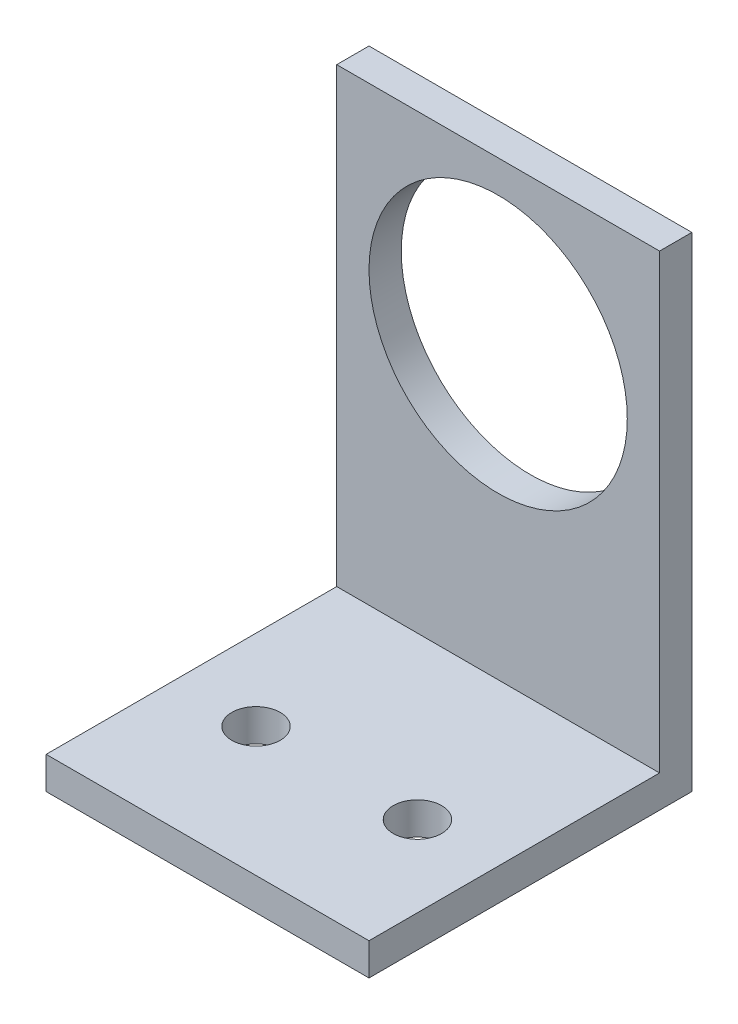
ISO-10303-21;
HEADER;
FILE_DESCRIPTION(('STEP AP214'),'2;1');
FILE_NAME('part.step','',(''),(''),'','','');
FILE_SCHEMA(('AUTOMOTIVE_DESIGN { 1 0 10303 214 1 1 1 1 }'));
ENDSEC;
DATA;
#1=APPLICATION_CONTEXT('core data for automotive mechanical design processes');
#2=APPLICATION_PROTOCOL_DEFINITION('international standard','automotive_design',2000,#1);
#3=PRODUCT_CONTEXT('',#1,'mechanical');
#4=PRODUCT('Part','Part','',(#3));
#5=PRODUCT_RELATED_PRODUCT_CATEGORY('part','',(#4));
#6=PRODUCT_DEFINITION_FORMATION('','',#4);
#7=PRODUCT_DEFINITION_CONTEXT('part definition',#1,'design');
#8=PRODUCT_DEFINITION('design','',#6,#7);
#9=PRODUCT_DEFINITION_SHAPE('','',#8);
#10=(LENGTH_UNIT() NAMED_UNIT(*) SI_UNIT(.MILLI.,.METRE.));
#11=(NAMED_UNIT(*) PLANE_ANGLE_UNIT() SI_UNIT($,.RADIAN.));
#12=(NAMED_UNIT(*) SI_UNIT($,.STERADIAN.) SOLID_ANGLE_UNIT());
#13=UNCERTAINTY_MEASURE_WITH_UNIT(LENGTH_MEASURE(1.E-05),#10,'distance_accuracy_value','');
#14=(GEOMETRIC_REPRESENTATION_CONTEXT(3) GLOBAL_UNCERTAINTY_ASSIGNED_CONTEXT((#13)) GLOBAL_UNIT_ASSIGNED_CONTEXT((#10,
#11,#12)) REPRESENTATION_CONTEXT('',''));
#15=CARTESIAN_POINT('',(0.,0.,0.));
#16=DIRECTION('',(0.,0.,1.));
#17=DIRECTION('',(1.,0.,0.));
#18=AXIS2_PLACEMENT_3D('',#15,#16,#17);
#19=CARTESIAN_POINT('',(10.,19.,3.));
#20=DIRECTION('',(-1.,0.,0.));
#21=DIRECTION('',(0.,-1.,0.));
#22=AXIS2_PLACEMENT_3D('',#19,#20,#21);
#23=PLANE('',#22);
#24=DIRECTION('',(0.,-1.,0.));
#25=VECTOR('',#24,1.);
#26=CARTESIAN_POINT('',(10.,19.,1.));
#27=LINE('',#26,#25);
#28=CARTESIAN_POINT('',(10.,11.,1.));
#29=VERTEX_POINT('',#28);
#30=CARTESIAN_POINT('',(10.,-19.,1.));
#31=VERTEX_POINT('',#30);
#32=EDGE_CURVE('E87',#29,#31,#27,.T.);
#33=ORIENTED_EDGE('',*,*,#32,.F.);
#34=DIRECTION('',(0.,0.,1.));
#35=VECTOR('',#34,1.);
#36=CARTESIAN_POINT('',(10.,11.,3.));
#37=LINE('',#36,#35);
#38=CARTESIAN_POINT('',(10.,11.,3.));
#39=VERTEX_POINT('',#38);
#40=EDGE_CURVE('E94',#29,#39,#37,.T.);
#41=ORIENTED_EDGE('',*,*,#40,.T.);
#42=DIRECTION('',(0.,1.,0.));
#43=VECTOR('',#42,1.);
#44=CARTESIAN_POINT('',(10.,19.,3.));
#45=LINE('',#44,#43);
#46=CARTESIAN_POINT('',(10.,-17.,3.));
#47=VERTEX_POINT('',#46);
#48=EDGE_CURVE('E128',#47,#39,#45,.T.);
#49=ORIENTED_EDGE('',*,*,#48,.F.);
#50=DIRECTION('',(0.,0.,-1.));
#51=VECTOR('',#50,1.);
#52=CARTESIAN_POINT('',(10.,-17.,3.));
#53=LINE('',#52,#51);
#54=CARTESIAN_POINT('',(10.,-17.,21.));
#55=VERTEX_POINT('',#54);
#56=EDGE_CURVE('E139',#55,#47,#53,.T.);
#57=ORIENTED_EDGE('',*,*,#56,.F.);
#58=DIRECTION('',(0.,-1.,0.));
#59=VECTOR('',#58,1.);
#60=CARTESIAN_POINT('',(10.,19.,21.));
#61=LINE('',#60,#59);
#62=CARTESIAN_POINT('',(10.,-19.,21.));
#63=VERTEX_POINT('',#62);
#64=EDGE_CURVE('E114',#55,#63,#61,.T.);
#65=ORIENTED_EDGE('',*,*,#64,.T.);
#66=DIRECTION('',(0.,0.,-1.));
#67=VECTOR('',#66,1.);
#68=CARTESIAN_POINT('',(10.,-19.,3.));
#69=LINE('',#68,#67);
#70=EDGE_CURVE('E97',#63,#31,#69,.T.);
#71=ORIENTED_EDGE('',*,*,#70,.T.);
#72=EDGE_LOOP('',(#33,#41,#49,#57,#65,#71));
#73=FACE_BOUND('',#72,.T.);
#74=ADVANCED_FACE('F35',(#73),#23,.F.);
#75=CARTESIAN_POINT('',(-10.,19.,3.));
#76=DIRECTION('',(1.,0.,0.));
#77=DIRECTION('',(0.,1.,0.));
#78=AXIS2_PLACEMENT_3D('',#75,#76,#77);
#79=PLANE('',#78);
#80=DIRECTION('',(0.,1.,0.));
#81=VECTOR('',#80,1.);
#82=CARTESIAN_POINT('',(-10.,19.,1.));
#83=LINE('',#82,#81);
#84=CARTESIAN_POINT('',(-9.99999999999999,-19.,1.));
#85=VERTEX_POINT('',#84);
#86=CARTESIAN_POINT('',(-10.,11.,1.));
#87=VERTEX_POINT('',#86);
#88=EDGE_CURVE('E48',#85,#87,#83,.T.);
#89=ORIENTED_EDGE('',*,*,#88,.F.);
#90=DIRECTION('',(0.,0.,-1.));
#91=VECTOR('',#90,1.);
#92=CARTESIAN_POINT('',(-9.99999999999999,-19.,3.));
#93=LINE('',#92,#91);
#94=CARTESIAN_POINT('',(-9.99999999999999,-19.,21.));
#95=VERTEX_POINT('',#94);
#96=EDGE_CURVE('E133',#95,#85,#93,.T.);
#97=ORIENTED_EDGE('',*,*,#96,.F.);
#98=DIRECTION('',(0.,1.,0.));
#99=VECTOR('',#98,1.);
#100=CARTESIAN_POINT('',(-10.,19.,21.));
#101=LINE('',#100,#99);
#102=CARTESIAN_POINT('',(-9.99999999999999,-17.,21.));
#103=VERTEX_POINT('',#102);
#104=EDGE_CURVE('E106',#95,#103,#101,.T.);
#105=ORIENTED_EDGE('',*,*,#104,.T.);
#106=DIRECTION('',(0.,0.,1.));
#107=VECTOR('',#106,1.);
#108=CARTESIAN_POINT('',(-9.99999999999999,-17.,3.));
#109=LINE('',#108,#107);
#110=CARTESIAN_POINT('',(-9.99999999999999,-17.,3.));
#111=VERTEX_POINT('',#110);
#112=EDGE_CURVE('E56',#111,#103,#109,.T.);
#113=ORIENTED_EDGE('',*,*,#112,.F.);
#114=DIRECTION('',(0.,-1.,0.));
#115=VECTOR('',#114,1.);
#116=CARTESIAN_POINT('',(-10.,19.,3.));
#117=LINE('',#116,#115);
#118=CARTESIAN_POINT('',(-10.,11.,3.));
#119=VERTEX_POINT('',#118);
#120=EDGE_CURVE('E130',#119,#111,#117,.T.);
#121=ORIENTED_EDGE('',*,*,#120,.F.);
#122=DIRECTION('',(0.,0.,-1.));
#123=VECTOR('',#122,1.);
#124=CARTESIAN_POINT('',(-10.,11.,3.));
#125=LINE('',#124,#123);
#126=EDGE_CURVE('E104',#119,#87,#125,.T.);
#127=ORIENTED_EDGE('',*,*,#126,.T.);
#128=EDGE_LOOP('',(#89,#97,#105,#113,#121,#127));
#129=FACE_BOUND('',#128,.T.);
#130=ADVANCED_FACE('F180',(#129),#79,.F.);
#131=CARTESIAN_POINT('',(-9.99999999999999,-19.,3.));
#132=DIRECTION('',(0.,1.,0.));
#133=DIRECTION('',(0.,0.,1.));
#134=AXIS2_PLACEMENT_3D('',#131,#132,#133);
#135=PLANE('',#134);
#136=CARTESIAN_POINT('',(-4.99999999999999,-19.,13.));
#137=DIRECTION('',(0.,1.,0.));
#138=DIRECTION('',(0.,0.,1.));
#139=AXIS2_PLACEMENT_3D('',#136,#137,#138);
#140=CIRCLE('',#139,1.5);
#141=CARTESIAN_POINT('',(-4.99999999999999,-19.,14.5));
#142=VERTEX_POINT('',#141);
#143=EDGE_CURVE('E125',#142,#142,#140,.T.);
#144=ORIENTED_EDGE('',*,*,#143,.T.);
#145=EDGE_LOOP('',(#144));
#146=FACE_BOUND('',#145,.T.);
#147=CARTESIAN_POINT('',(5.,-19.,13.));
#148=DIRECTION('',(0.,1.,0.));
#149=DIRECTION('',(0.,0.,1.));
#150=AXIS2_PLACEMENT_3D('',#147,#148,#149);
#151=CIRCLE('',#150,1.5);
#152=CARTESIAN_POINT('',(5.,-19.,14.5));
#153=VERTEX_POINT('',#152);
#154=EDGE_CURVE('E122',#153,#153,#151,.T.);
#155=ORIENTED_EDGE('',*,*,#154,.T.);
#156=EDGE_LOOP('',(#155));
#157=FACE_BOUND('',#156,.T.);
#158=DIRECTION('',(-1.,0.,0.));
#159=VECTOR('',#158,1.);
#160=CARTESIAN_POINT('',(-9.99999999999999,-19.,1.));
#161=LINE('',#160,#159);
#162=EDGE_CURVE('E98',#31,#85,#161,.T.);
#163=ORIENTED_EDGE('',*,*,#162,.F.);
#164=ORIENTED_EDGE('',*,*,#70,.F.);
#165=DIRECTION('',(-1.,0.,0.));
#166=VECTOR('',#165,1.);
#167=CARTESIAN_POINT('',(-9.99999999999999,-19.,21.));
#168=LINE('',#167,#166);
#169=EDGE_CURVE('E116',#63,#95,#168,.T.);
#170=ORIENTED_EDGE('',*,*,#169,.T.);
#171=ORIENTED_EDGE('',*,*,#96,.T.);
#172=EDGE_LOOP('',(#163,#164,#170,#171));
#173=FACE_BOUND('',#172,.T.);
#174=ADVANCED_FACE('F150',(#146,#157,#173),#135,.F.);
#175=CARTESIAN_POINT('',(0.,0.999999999999997,10.));
#176=DIRECTION('',(0.,0.,-1.));
#177=DIRECTION('',(-1.,0.,0.));
#178=AXIS2_PLACEMENT_3D('',#175,#176,#177);
#179=CYLINDRICAL_SURFACE('',#178,8.);
#180=CARTESIAN_POINT('',(0.,0.999999999999997,3.));
#181=DIRECTION('',(0.,0.,1.));
#182=DIRECTION('',(1.,0.,0.));
#183=AXIS2_PLACEMENT_3D('',#180,#181,#182);
#184=CIRCLE('',#183,8.);
#185=CARTESIAN_POINT('',(8.,0.999999999999997,3.));
#186=VERTEX_POINT('',#185);
#187=EDGE_CURVE('E119',#186,#186,#184,.T.);
#188=ORIENTED_EDGE('',*,*,#187,.T.);
#189=EDGE_LOOP('',(#188));
#190=FACE_BOUND('',#189,.T.);
#191=CARTESIAN_POINT('',(0.,0.999999999999997,0.999999999999999));
#192=DIRECTION('',(0.,0.,-1.));
#193=DIRECTION('',(-1.,0.,0.));
#194=AXIS2_PLACEMENT_3D('',#191,#192,#193);
#195=CIRCLE('',#194,8.);
#196=CARTESIAN_POINT('',(-8.,0.999999999999997,0.999999999999999));
#197=VERTEX_POINT('',#196);
#198=EDGE_CURVE('E151',#197,#197,#195,.F.);
#199=ORIENTED_EDGE('',*,*,#198,.F.);
#200=EDGE_LOOP('',(#199));
#201=FACE_BOUND('',#200,.T.);
#202=ADVANCED_FACE('F175',(#190,#201),#179,.F.);
#203=CARTESIAN_POINT('',(0.,11.,0.));
#204=DIRECTION('',(0.,-1.,0.));
#205=DIRECTION('',(0.,0.,-1.));
#206=AXIS2_PLACEMENT_3D('',#203,#204,#205);
#207=PLANE('',#206);
#208=DIRECTION('',(1.,0.,0.));
#209=VECTOR('',#208,1.);
#210=CARTESIAN_POINT('',(0.,11.,1.));
#211=LINE('',#210,#209);
#212=EDGE_CURVE('E11',#87,#29,#211,.T.);
#213=ORIENTED_EDGE('',*,*,#212,.F.);
#214=ORIENTED_EDGE('',*,*,#126,.F.);
#215=DIRECTION('',(1.,0.,0.));
#216=VECTOR('',#215,1.);
#217=CARTESIAN_POINT('',(0.,11.,3.));
#218=LINE('',#217,#216);
#219=EDGE_CURVE('E102',#119,#39,#218,.T.);
#220=ORIENTED_EDGE('',*,*,#219,.T.);
#221=ORIENTED_EDGE('',*,*,#40,.F.);
#222=EDGE_LOOP('',(#213,#214,#220,#221));
#223=FACE_BOUND('',#222,.T.);
#224=ADVANCED_FACE('F100',(#223),#207,.F.);
#225=CARTESIAN_POINT('',(-4.99999999999999,-26.,13.));
#226=DIRECTION('',(0.,1.,0.));
#227=DIRECTION('',(0.,0.,1.));
#228=AXIS2_PLACEMENT_3D('',#225,#226,#227);
#229=CYLINDRICAL_SURFACE('',#228,1.5);
#230=ORIENTED_EDGE('',*,*,#143,.F.);
#231=EDGE_LOOP('',(#230));
#232=FACE_BOUND('',#231,.T.);
#233=CARTESIAN_POINT('',(-4.99999999999999,-17.,13.));
#234=DIRECTION('',(0.,1.,0.));
#235=DIRECTION('',(0.,0.,1.));
#236=AXIS2_PLACEMENT_3D('',#233,#234,#235);
#237=CIRCLE('',#236,1.5);
#238=CARTESIAN_POINT('',(-4.99999999999999,-17.,14.5));
#239=VERTEX_POINT('',#238);
#240=EDGE_CURVE('E108',#239,#239,#237,.F.);
#241=ORIENTED_EDGE('',*,*,#240,.F.);
#242=EDGE_LOOP('',(#241));
#243=FACE_BOUND('',#242,.T.);
#244=ADVANCED_FACE('F164',(#232,#243),#229,.F.);
#245=CARTESIAN_POINT('',(5.,-26.,13.));
#246=DIRECTION('',(0.,1.,0.));
#247=DIRECTION('',(0.,0.,1.));
#248=AXIS2_PLACEMENT_3D('',#245,#246,#247);
#249=CYLINDRICAL_SURFACE('',#248,1.5);
#250=ORIENTED_EDGE('',*,*,#154,.F.);
#251=EDGE_LOOP('',(#250));
#252=FACE_BOUND('',#251,.T.);
#253=CARTESIAN_POINT('',(5.,-17.,13.));
#254=DIRECTION('',(0.,1.,0.));
#255=DIRECTION('',(0.,0.,1.));
#256=AXIS2_PLACEMENT_3D('',#253,#254,#255);
#257=CIRCLE('',#256,1.5);
#258=CARTESIAN_POINT('',(5.,-17.,14.5));
#259=VERTEX_POINT('',#258);
#260=EDGE_CURVE('E144',#259,#259,#257,.F.);
#261=ORIENTED_EDGE('',*,*,#260,.F.);
#262=EDGE_LOOP('',(#261));
#263=FACE_BOUND('',#262,.T.);
#264=ADVANCED_FACE('F166',(#252,#263),#249,.F.);
#265=CARTESIAN_POINT('',(0.,0.,21.));
#266=DIRECTION('',(0.,0.,-1.));
#267=DIRECTION('',(-1.,0.,0.));
#268=AXIS2_PLACEMENT_3D('',#265,#266,#267);
#269=PLANE('',#268);
#270=DIRECTION('',(1.,0.,0.));
#271=VECTOR('',#270,1.);
#272=CARTESIAN_POINT('',(0.,-17.,21.));
#273=LINE('',#272,#271);
#274=EDGE_CURVE('E42',#103,#55,#273,.T.);
#275=ORIENTED_EDGE('',*,*,#274,.F.);
#276=ORIENTED_EDGE('',*,*,#104,.F.);
#277=ORIENTED_EDGE('',*,*,#169,.F.);
#278=ORIENTED_EDGE('',*,*,#64,.F.);
#279=EDGE_LOOP('',(#275,#276,#277,#278));
#280=FACE_BOUND('',#279,.T.);
#281=ADVANCED_FACE('F147',(#280),#269,.F.);
#282=CARTESIAN_POINT('',(0.,0.,3.));
#283=DIRECTION('',(0.,0.,1.));
#284=DIRECTION('',(1.,0.,0.));
#285=AXIS2_PLACEMENT_3D('',#282,#283,#284);
#286=PLANE('',#285);
#287=ORIENTED_EDGE('',*,*,#219,.F.);
#288=ORIENTED_EDGE('',*,*,#120,.T.);
#289=DIRECTION('',(-1.,0.,0.));
#290=VECTOR('',#289,1.);
#291=CARTESIAN_POINT('',(-9.99999999999999,-17.,3.));
#292=LINE('',#291,#290);
#293=EDGE_CURVE('E145',#47,#111,#292,.T.);
#294=ORIENTED_EDGE('',*,*,#293,.F.);
#295=ORIENTED_EDGE('',*,*,#48,.T.);
#296=EDGE_LOOP('',(#287,#288,#294,#295));
#297=FACE_BOUND('',#296,.T.);
#298=ORIENTED_EDGE('',*,*,#187,.F.);
#299=EDGE_LOOP('',(#298));
#300=FACE_BOUND('',#299,.T.);
#301=ADVANCED_FACE('F190',(#297,#300),#286,.T.);
#302=CARTESIAN_POINT('',(0.,-17.,0.));
#303=DIRECTION('',(0.,1.,0.));
#304=DIRECTION('',(0.,0.,1.));
#305=AXIS2_PLACEMENT_3D('',#302,#303,#304);
#306=PLANE('',#305);
#307=ORIENTED_EDGE('',*,*,#56,.T.);
#308=ORIENTED_EDGE('',*,*,#293,.T.);
#309=ORIENTED_EDGE('',*,*,#112,.T.);
#310=ORIENTED_EDGE('',*,*,#274,.T.);
#311=EDGE_LOOP('',(#307,#308,#309,#310));
#312=FACE_BOUND('',#311,.T.);
#313=ORIENTED_EDGE('',*,*,#260,.T.);
#314=EDGE_LOOP('',(#313));
#315=FACE_BOUND('',#314,.T.);
#316=ORIENTED_EDGE('',*,*,#240,.T.);
#317=EDGE_LOOP('',(#316));
#318=FACE_BOUND('',#317,.T.);
#319=ADVANCED_FACE('F137',(#312,#315,#318),#306,.T.);
#320=CARTESIAN_POINT('',(0.,0.,1.));
#321=DIRECTION('',(0.,0.,-1.));
#322=DIRECTION('',(-1.,0.,0.));
#323=AXIS2_PLACEMENT_3D('',#320,#321,#322);
#324=PLANE('',#323);
#325=ORIENTED_EDGE('',*,*,#162,.T.);
#326=ORIENTED_EDGE('',*,*,#88,.T.);
#327=ORIENTED_EDGE('',*,*,#212,.T.);
#328=ORIENTED_EDGE('',*,*,#32,.T.);
#329=EDGE_LOOP('',(#325,#326,#327,#328));
#330=FACE_BOUND('',#329,.T.);
#331=ORIENTED_EDGE('',*,*,#198,.T.);
#332=EDGE_LOOP('',(#331));
#333=FACE_BOUND('',#332,.T.);
#334=ADVANCED_FACE('F85',(#330,#333),#324,.T.);
#335=CLOSED_SHELL('',(#74,#130,#174,#202,#224,#244,#264,#281,#301,#319,#334));
#336=MANIFOLD_SOLID_BREP('B2',#335);
#337=ADVANCED_BREP_SHAPE_REPRESENTATION('',(#18,#336),#14);
#338=SHAPE_DEFINITION_REPRESENTATION(#9,#337);
ENDSEC;
END-ISO-10303-21;
